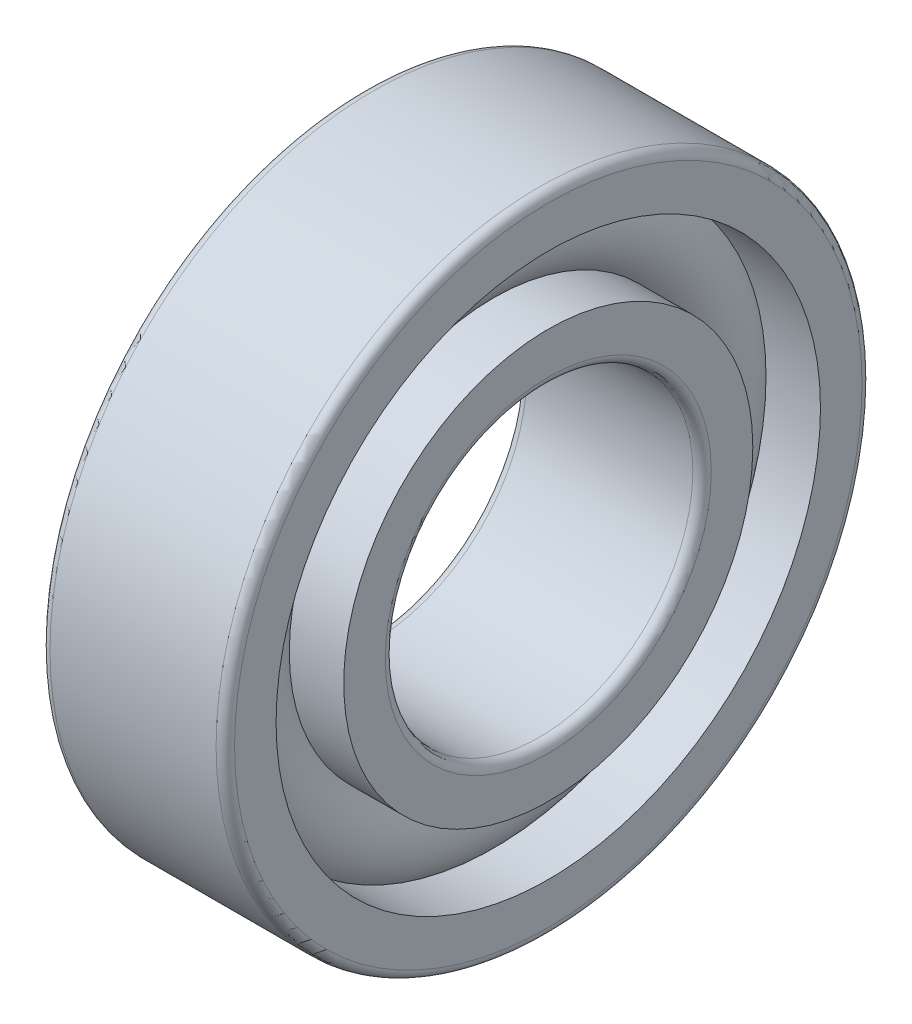
ISO-10303-21;
HEADER;
FILE_DESCRIPTION(('STEP AP214'),'2;1');
FILE_NAME('part.step','',(''),(''),'','','');
FILE_SCHEMA(('AUTOMOTIVE_DESIGN { 1 0 10303 214 1 1 1 1 }'));
ENDSEC;
DATA;
#1=APPLICATION_CONTEXT('core data for automotive mechanical design processes');
#2=APPLICATION_PROTOCOL_DEFINITION('international standard','automotive_design',2000,#1);
#3=PRODUCT_CONTEXT('',#1,'mechanical');
#4=PRODUCT('Part','Part','',(#3));
#5=PRODUCT_RELATED_PRODUCT_CATEGORY('part','',(#4));
#6=PRODUCT_DEFINITION_FORMATION('','',#4);
#7=PRODUCT_DEFINITION_CONTEXT('part definition',#1,'design');
#8=PRODUCT_DEFINITION('design','',#6,#7);
#9=PRODUCT_DEFINITION_SHAPE('','',#8);
#10=(LENGTH_UNIT() NAMED_UNIT(*) SI_UNIT(.MILLI.,.METRE.));
#11=(NAMED_UNIT(*) PLANE_ANGLE_UNIT() SI_UNIT($,.RADIAN.));
#12=(NAMED_UNIT(*) SI_UNIT($,.STERADIAN.) SOLID_ANGLE_UNIT());
#13=UNCERTAINTY_MEASURE_WITH_UNIT(LENGTH_MEASURE(1.E-05),#10,'distance_accuracy_value','');
#14=(GEOMETRIC_REPRESENTATION_CONTEXT(3) GLOBAL_UNCERTAINTY_ASSIGNED_CONTEXT((#13)) GLOBAL_UNIT_ASSIGNED_CONTEXT((#10,
#11,#12)) REPRESENTATION_CONTEXT('',''));
#15=CARTESIAN_POINT('',(0.,0.,0.));
#16=DIRECTION('',(0.,0.,1.));
#17=DIRECTION('',(1.,0.,0.));
#18=AXIS2_PLACEMENT_3D('',#15,#16,#17);
#19=CARTESIAN_POINT('',(7.66380393065447,4.05709219205619,-6.80041344122628));
#20=DIRECTION('',(-1.,0.,0.));
#21=DIRECTION('',(0.,0.,1.));
#22=AXIS2_PLACEMENT_3D('',#19,#20,#21);
#23=TOROIDAL_SURFACE('',#22,15.5,3.3);
#24=CARTESIAN_POINT('',(10.1234787059042,4.05709219205619,-6.80041344122628));
#25=DIRECTION('',(-1.,0.,0.));
#26=DIRECTION('',(0.,0.,1.));
#27=AXIS2_PLACEMENT_3D('',#24,#25,#26);
#28=CIRCLE('',#27,17.7);
#29=CARTESIAN_POINT('',(10.1234787059042,4.05709219205619,10.8995865587737));
#30=VERTEX_POINT('',#29);
#31=EDGE_CURVE('E18',#30,#30,#28,.F.);
#32=ORIENTED_EDGE('',*,*,#31,.T.);
#33=EDGE_LOOP('',(#32));
#34=FACE_BOUND('',#33,.T.);
#35=CARTESIAN_POINT('',(10.1234787059042,4.05709219205619,-6.80041344122628));
#36=DIRECTION('',(-1.,0.,0.));
#37=DIRECTION('',(0.,0.,1.));
#38=AXIS2_PLACEMENT_3D('',#35,#36,#37);
#39=CIRCLE('',#38,13.3);
#40=CARTESIAN_POINT('',(10.1234787059042,4.05709219205619,6.49958655877372));
#41=VERTEX_POINT('',#40);
#42=EDGE_CURVE('E10',#41,#41,#39,.T.);
#43=ORIENTED_EDGE('',*,*,#42,.T.);
#44=EDGE_LOOP('',(#43));
#45=FACE_BOUND('',#44,.T.);
#46=ADVANCED_FACE('F14',(#34,#45),#23,.T.);
#47=CARTESIAN_POINT('',(-12.9736960693455,4.05709219205619,-6.80041344122628));
#48=DIRECTION('',(1.,0.,0.));
#49=DIRECTION('',(0.,0.,-1.));
#50=AXIS2_PLACEMENT_3D('',#47,#48,#49);
#51=CYLINDRICAL_SURFACE('',#50,13.3);
#52=CARTESIAN_POINT('',(13.6638039306545,4.05709219205619,-6.80041344122628));
#53=DIRECTION('',(1.,0.,0.));
#54=DIRECTION('',(0.,0.,-1.));
#55=AXIS2_PLACEMENT_3D('',#52,#53,#54);
#56=CIRCLE('',#55,13.3);
#57=CARTESIAN_POINT('',(13.6638039306545,4.05709219205619,-20.1004134412263));
#58=VERTEX_POINT('',#57);
#59=EDGE_CURVE('E27',#58,#58,#56,.T.);
#60=ORIENTED_EDGE('',*,*,#59,.F.);
#61=EDGE_LOOP('',(#60));
#62=FACE_BOUND('',#61,.T.);
#63=ORIENTED_EDGE('',*,*,#42,.F.);
#64=EDGE_LOOP('',(#63));
#65=FACE_BOUND('',#64,.T.);
#66=ADVANCED_FACE('F66',(#62,#65),#51,.T.);
#67=CARTESIAN_POINT('',(-12.9736960693455,4.05709219205619,-6.80041344122628));
#68=DIRECTION('',(1.,0.,0.));
#69=DIRECTION('',(0.,0.,-1.));
#70=AXIS2_PLACEMENT_3D('',#67,#68,#69);
#71=CYLINDRICAL_SURFACE('',#70,13.3);
#72=CARTESIAN_POINT('',(1.66380393065447,4.05709219205619,-6.80041344122628));
#73=DIRECTION('',(1.,0.,0.));
#74=DIRECTION('',(0.,0.,-1.));
#75=AXIS2_PLACEMENT_3D('',#72,#73,#74);
#76=CIRCLE('',#75,13.3);
#77=CARTESIAN_POINT('',(1.66380393065447,4.05709219205619,-20.1004134412263));
#78=VERTEX_POINT('',#77);
#79=EDGE_CURVE('E36',#78,#78,#76,.T.);
#80=ORIENTED_EDGE('',*,*,#79,.T.);
#81=EDGE_LOOP('',(#80));
#82=FACE_BOUND('',#81,.T.);
#83=CARTESIAN_POINT('',(5.2041291554047,4.05709219205619,-6.80041344122628));
#84=DIRECTION('',(1.,0.,0.));
#85=DIRECTION('',(0.,0.,-1.));
#86=AXIS2_PLACEMENT_3D('',#83,#84,#85);
#87=CIRCLE('',#86,13.3);
#88=CARTESIAN_POINT('',(5.2041291554047,4.05709219205619,-20.1004134412263));
#89=VERTEX_POINT('',#88);
#90=EDGE_CURVE('E22',#89,#89,#87,.T.);
#91=ORIENTED_EDGE('',*,*,#90,.F.);
#92=EDGE_LOOP('',(#91));
#93=FACE_BOUND('',#92,.T.);
#94=ADVANCED_FACE('F69',(#82,#93),#71,.T.);
#95=CARTESIAN_POINT('',(13.6638039306545,14.6570921920562,-6.80041344122628));
#96=DIRECTION('',(1.,0.,0.));
#97=DIRECTION('',(0.,0.,-1.));
#98=AXIS2_PLACEMENT_3D('',#95,#96,#97);
#99=PLANE('',#98);
#100=ORIENTED_EDGE('',*,*,#59,.T.);
#101=EDGE_LOOP('',(#100));
#102=FACE_BOUND('',#101,.T.);
#103=CARTESIAN_POINT('',(13.6638039306545,4.05709219205619,-6.80041344122628));
#104=DIRECTION('',(1.,0.,0.));
#105=DIRECTION('',(0.,0.,-1.));
#106=AXIS2_PLACEMENT_3D('',#103,#104,#105);
#107=CIRCLE('',#106,10.6);
#108=CARTESIAN_POINT('',(13.6638039306545,4.05709219205619,-17.4004134412263));
#109=VERTEX_POINT('',#108);
#110=EDGE_CURVE('E58',#109,#109,#107,.T.);
#111=ORIENTED_EDGE('',*,*,#110,.F.);
#112=EDGE_LOOP('',(#111));
#113=FACE_BOUND('',#112,.T.);
#114=ADVANCED_FACE('F63',(#102,#113),#99,.T.);
#115=CARTESIAN_POINT('',(13.0638039306545,4.05709219205619,-6.80041344122628));
#116=DIRECTION('',(1.,0.,0.));
#117=DIRECTION('',(0.,0.,-1.));
#118=AXIS2_PLACEMENT_3D('',#115,#116,#117);
#119=TOROIDAL_SURFACE('',#118,10.6,0.6);
#120=ORIENTED_EDGE('',*,*,#110,.T.);
#121=EDGE_LOOP('',(#120));
#122=FACE_BOUND('',#121,.T.);
#123=CARTESIAN_POINT('',(13.0638039306545,4.05709219205619,-6.80041344122628));
#124=DIRECTION('',(1.,0.,0.));
#125=DIRECTION('',(0.,0.,-1.));
#126=AXIS2_PLACEMENT_3D('',#123,#124,#125);
#127=CIRCLE('',#126,10.);
#128=CARTESIAN_POINT('',(13.0638039306545,4.05709219205619,-16.8004134412263));
#129=VERTEX_POINT('',#128);
#130=EDGE_CURVE('E55',#129,#129,#127,.T.);
#131=ORIENTED_EDGE('',*,*,#130,.F.);
#132=EDGE_LOOP('',(#131));
#133=FACE_BOUND('',#132,.T.);
#134=ADVANCED_FACE('F81',(#122,#133),#119,.T.);
#135=CARTESIAN_POINT('',(-12.9736960693455,4.05709219205619,-6.80041344122628));
#136=DIRECTION('',(1.,0.,0.));
#137=DIRECTION('',(0.,0.,-1.));
#138=AXIS2_PLACEMENT_3D('',#135,#136,#137);
#139=CYLINDRICAL_SURFACE('',#138,10.);
#140=ORIENTED_EDGE('',*,*,#130,.T.);
#141=EDGE_LOOP('',(#140));
#142=FACE_BOUND('',#141,.T.);
#143=CARTESIAN_POINT('',(2.26380393065447,4.05709219205619,-6.80041344122628));
#144=DIRECTION('',(1.,0.,0.));
#145=DIRECTION('',(0.,0.,-1.));
#146=AXIS2_PLACEMENT_3D('',#143,#144,#145);
#147=CIRCLE('',#146,10.);
#148=CARTESIAN_POINT('',(2.26380393065447,4.05709219205619,-16.8004134412263));
#149=VERTEX_POINT('',#148);
#150=EDGE_CURVE('E52',#149,#149,#147,.T.);
#151=ORIENTED_EDGE('',*,*,#150,.F.);
#152=EDGE_LOOP('',(#151));
#153=FACE_BOUND('',#152,.T.);
#154=ADVANCED_FACE('F84',(#142,#153),#139,.F.);
#155=CARTESIAN_POINT('',(2.26380393065447,4.05709219205619,-6.80041344122628));
#156=DIRECTION('',(1.,0.,0.));
#157=DIRECTION('',(0.,0.,-1.));
#158=AXIS2_PLACEMENT_3D('',#155,#156,#157);
#159=TOROIDAL_SURFACE('',#158,10.6,0.6);
#160=ORIENTED_EDGE('',*,*,#150,.T.);
#161=EDGE_LOOP('',(#160));
#162=FACE_BOUND('',#161,.T.);
#163=CARTESIAN_POINT('',(1.66380393065447,4.05709219205619,-6.80041344122628));
#164=DIRECTION('',(1.,0.,0.));
#165=DIRECTION('',(0.,0.,-1.));
#166=AXIS2_PLACEMENT_3D('',#163,#164,#165);
#167=CIRCLE('',#166,10.6);
#168=CARTESIAN_POINT('',(1.66380393065447,4.05709219205619,-17.4004134412263));
#169=VERTEX_POINT('',#168);
#170=EDGE_CURVE('E49',#169,#169,#167,.T.);
#171=ORIENTED_EDGE('',*,*,#170,.F.);
#172=EDGE_LOOP('',(#171));
#173=FACE_BOUND('',#172,.T.);
#174=ADVANCED_FACE('F88',(#162,#173),#159,.T.);
#175=CARTESIAN_POINT('',(1.66380393065447,17.3570921920562,-6.80041344122628));
#176=DIRECTION('',(-1.,0.,0.));
#177=DIRECTION('',(0.,0.,1.));
#178=AXIS2_PLACEMENT_3D('',#175,#176,#177);
#179=PLANE('',#178);
#180=ORIENTED_EDGE('',*,*,#170,.T.);
#181=EDGE_LOOP('',(#180));
#182=FACE_BOUND('',#181,.T.);
#183=ORIENTED_EDGE('',*,*,#79,.F.);
#184=EDGE_LOOP('',(#183));
#185=FACE_BOUND('',#184,.T.);
#186=ADVANCED_FACE('F92',(#182,#185),#179,.T.);
#187=CARTESIAN_POINT('',(5.2041291554047,4.05709219205619,-6.80041344122628));
#188=DIRECTION('',(1.,0.,0.));
#189=DIRECTION('',(0.,0.,-1.));
#190=AXIS2_PLACEMENT_3D('',#187,#188,#189);
#191=CIRCLE('',#190,17.7);
#192=CARTESIAN_POINT('',(5.2041291554047,4.05709219205619,-24.5004134412263));
#193=VERTEX_POINT('',#192);
#194=EDGE_CURVE('E30',#193,#193,#191,.F.);
#195=ORIENTED_EDGE('',*,*,#194,.T.);
#196=EDGE_LOOP('',(#195));
#197=FACE_BOUND('',#196,.T.);
#198=ORIENTED_EDGE('',*,*,#90,.T.);
#199=EDGE_LOOP('',(#198));
#200=FACE_BOUND('',#199,.T.);
#201=ADVANCED_FACE('F16',(#197,#200),#23,.T.);
#202=CARTESIAN_POINT('',(-12.9736960693455,4.05709219205619,-6.80041344122628));
#203=DIRECTION('',(1.,0.,0.));
#204=DIRECTION('',(0.,0.,-1.));
#205=AXIS2_PLACEMENT_3D('',#202,#203,#204);
#206=CYLINDRICAL_SURFACE('',#205,17.7);
#207=CARTESIAN_POINT('',(13.6638039306545,4.05709219205619,-6.80041344122628));
#208=DIRECTION('',(1.,0.,0.));
#209=DIRECTION('',(0.,0.,-1.));
#210=AXIS2_PLACEMENT_3D('',#207,#208,#209);
#211=CIRCLE('',#210,17.7);
#212=CARTESIAN_POINT('',(13.6638039306545,4.05709219205619,-24.5004134412263));
#213=VERTEX_POINT('',#212);
#214=EDGE_CURVE('E32',#213,#213,#211,.T.);
#215=ORIENTED_EDGE('',*,*,#214,.T.);
#216=EDGE_LOOP('',(#215));
#217=FACE_BOUND('',#216,.T.);
#218=ORIENTED_EDGE('',*,*,#31,.F.);
#219=EDGE_LOOP('',(#218));
#220=FACE_BOUND('',#219,.T.);
#221=ADVANCED_FACE('F97',(#217,#220),#206,.F.);
#222=CARTESIAN_POINT('',(-12.9736960693455,4.05709219205619,-6.80041344122628));
#223=DIRECTION('',(1.,0.,0.));
#224=DIRECTION('',(0.,0.,-1.));
#225=AXIS2_PLACEMENT_3D('',#222,#223,#224);
#226=CYLINDRICAL_SURFACE('',#225,17.7);
#227=CARTESIAN_POINT('',(1.66380393065447,4.05709219205619,-6.80041344122628));
#228=DIRECTION('',(1.,0.,0.));
#229=DIRECTION('',(0.,0.,-1.));
#230=AXIS2_PLACEMENT_3D('',#227,#228,#229);
#231=CIRCLE('',#230,17.7);
#232=CARTESIAN_POINT('',(1.66380393065447,4.05709219205619,-24.5004134412263));
#233=VERTEX_POINT('',#232);
#234=EDGE_CURVE('E128',#233,#233,#231,.T.);
#235=ORIENTED_EDGE('',*,*,#234,.F.);
#236=EDGE_LOOP('',(#235));
#237=FACE_BOUND('',#236,.T.);
#238=ORIENTED_EDGE('',*,*,#194,.F.);
#239=EDGE_LOOP('',(#238));
#240=FACE_BOUND('',#239,.T.);
#241=ADVANCED_FACE('F100',(#237,#240),#226,.F.);
#242=CARTESIAN_POINT('',(13.6638039306545,24.4570921920562,-6.80041344122628));
#243=DIRECTION('',(1.,0.,0.));
#244=DIRECTION('',(0.,0.,-1.));
#245=AXIS2_PLACEMENT_3D('',#242,#243,#244);
#246=PLANE('',#245);
#247=CARTESIAN_POINT('',(13.6638039306545,4.05709219205619,-6.80041344122628));
#248=DIRECTION('',(1.,0.,0.));
#249=DIRECTION('',(0.,0.,-1.));
#250=AXIS2_PLACEMENT_3D('',#247,#248,#249);
#251=CIRCLE('',#250,20.4);
#252=CARTESIAN_POINT('',(13.6638039306545,4.05709219205619,-27.2004134412263));
#253=VERTEX_POINT('',#252);
#254=EDGE_CURVE('E38',#253,#253,#251,.T.);
#255=ORIENTED_EDGE('',*,*,#254,.T.);
#256=EDGE_LOOP('',(#255));
#257=FACE_BOUND('',#256,.T.);
#258=ORIENTED_EDGE('',*,*,#214,.F.);
#259=EDGE_LOOP('',(#258));
#260=FACE_BOUND('',#259,.T.);
#261=ADVANCED_FACE('F101',(#257,#260),#246,.T.);
#262=CARTESIAN_POINT('',(13.0638039306545,4.05709219205619,-6.80041344122628));
#263=DIRECTION('',(1.,0.,0.));
#264=DIRECTION('',(0.,0.,-1.));
#265=AXIS2_PLACEMENT_3D('',#262,#263,#264);
#266=TOROIDAL_SURFACE('',#265,20.4,0.599999999999999);
#267=CARTESIAN_POINT('',(13.0638039306545,4.05709219205619,-6.80041344122628));
#268=DIRECTION('',(1.,0.,0.));
#269=DIRECTION('',(0.,0.,-1.));
#270=AXIS2_PLACEMENT_3D('',#267,#268,#269);
#271=CIRCLE('',#270,21.);
#272=CARTESIAN_POINT('',(13.0638039306545,4.05709219205619,-27.8004134412263));
#273=VERTEX_POINT('',#272);
#274=EDGE_CURVE('E43',#273,#273,#271,.T.);
#275=ORIENTED_EDGE('',*,*,#274,.T.);
#276=EDGE_LOOP('',(#275));
#277=FACE_BOUND('',#276,.T.);
#278=ORIENTED_EDGE('',*,*,#254,.F.);
#279=EDGE_LOOP('',(#278));
#280=FACE_BOUND('',#279,.T.);
#281=ADVANCED_FACE('F104',(#277,#280),#266,.T.);
#282=CARTESIAN_POINT('',(-12.9736960693455,4.05709219205619,-6.80041344122628));
#283=DIRECTION('',(1.,0.,0.));
#284=DIRECTION('',(0.,0.,-1.));
#285=AXIS2_PLACEMENT_3D('',#282,#283,#284);
#286=CYLINDRICAL_SURFACE('',#285,21.);
#287=CARTESIAN_POINT('',(2.26380393065447,4.05709219205619,-6.80041344122628));
#288=DIRECTION('',(1.,0.,0.));
#289=DIRECTION('',(0.,0.,-1.));
#290=AXIS2_PLACEMENT_3D('',#287,#288,#289);
#291=CIRCLE('',#290,21.);
#292=CARTESIAN_POINT('',(2.26380393065447,4.05709219205619,-27.8004134412263));
#293=VERTEX_POINT('',#292);
#294=EDGE_CURVE('E132',#293,#293,#291,.T.);
#295=ORIENTED_EDGE('',*,*,#294,.T.);
#296=EDGE_LOOP('',(#295));
#297=FACE_BOUND('',#296,.T.);
#298=ORIENTED_EDGE('',*,*,#274,.F.);
#299=EDGE_LOOP('',(#298));
#300=FACE_BOUND('',#299,.T.);
#301=ADVANCED_FACE('F108',(#297,#300),#286,.T.);
#302=CARTESIAN_POINT('',(2.26380393065447,4.05709219205619,-6.80041344122628));
#303=DIRECTION('',(1.,0.,0.));
#304=DIRECTION('',(0.,0.,-1.));
#305=AXIS2_PLACEMENT_3D('',#302,#303,#304);
#306=TOROIDAL_SURFACE('',#305,20.4,0.599999999999999);
#307=CARTESIAN_POINT('',(1.66380393065447,4.05709219205619,-6.80041344122628));
#308=DIRECTION('',(1.,0.,0.));
#309=DIRECTION('',(0.,0.,-1.));
#310=AXIS2_PLACEMENT_3D('',#307,#308,#309);
#311=CIRCLE('',#310,20.4);
#312=CARTESIAN_POINT('',(1.66380393065447,4.05709219205619,-27.2004134412263));
#313=VERTEX_POINT('',#312);
#314=EDGE_CURVE('E129',#313,#313,#311,.T.);
#315=ORIENTED_EDGE('',*,*,#314,.T.);
#316=EDGE_LOOP('',(#315));
#317=FACE_BOUND('',#316,.T.);
#318=ORIENTED_EDGE('',*,*,#294,.F.);
#319=EDGE_LOOP('',(#318));
#320=FACE_BOUND('',#319,.T.);
#321=ADVANCED_FACE('F112',(#317,#320),#306,.T.);
#322=CARTESIAN_POINT('',(1.66380393065447,21.7570921920562,-6.80041344122628));
#323=DIRECTION('',(-1.,0.,0.));
#324=DIRECTION('',(0.,0.,1.));
#325=AXIS2_PLACEMENT_3D('',#322,#323,#324);
#326=PLANE('',#325);
#327=ORIENTED_EDGE('',*,*,#234,.T.);
#328=EDGE_LOOP('',(#327));
#329=FACE_BOUND('',#328,.T.);
#330=ORIENTED_EDGE('',*,*,#314,.F.);
#331=EDGE_LOOP('',(#330));
#332=FACE_BOUND('',#331,.T.);
#333=ADVANCED_FACE('F116',(#329,#332),#326,.T.);
#334=CLOSED_SHELL('',(#46,#66,#94,#114,#134,#154,#174,#186,#201,#221,#241,#261,#281,#301,#321,#333));
#335=MANIFOLD_SOLID_BREP('B1',#334);
#336=ADVANCED_BREP_SHAPE_REPRESENTATION('',(#18,#335),#14);
#337=SHAPE_DEFINITION_REPRESENTATION(#9,#336);
ENDSEC;
END-ISO-10303-21;
